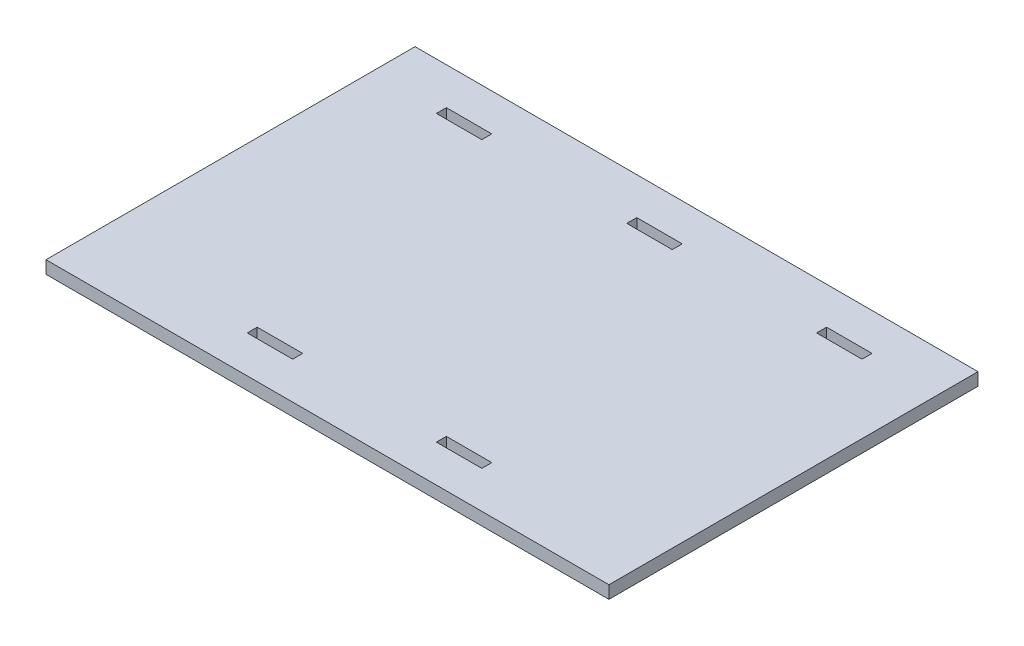
ISO-10303-21;
HEADER;
FILE_DESCRIPTION(('STEP AP214'),'2;1');
FILE_NAME('part.step','',(''),(''),'','','');
FILE_SCHEMA(('AUTOMOTIVE_DESIGN { 1 0 10303 214 1 1 1 1 }'));
ENDSEC;
DATA;
#1=APPLICATION_CONTEXT('core data for automotive mechanical design processes');
#2=APPLICATION_PROTOCOL_DEFINITION('international standard','automotive_design',2000,#1);
#3=PRODUCT_CONTEXT('',#1,'mechanical');
#4=PRODUCT('Part','Part','',(#3));
#5=PRODUCT_RELATED_PRODUCT_CATEGORY('part','',(#4));
#6=PRODUCT_DEFINITION_FORMATION('','',#4);
#7=PRODUCT_DEFINITION_CONTEXT('part definition',#1,'design');
#8=PRODUCT_DEFINITION('design','',#6,#7);
#9=PRODUCT_DEFINITION_SHAPE('','',#8);
#10=(LENGTH_UNIT() NAMED_UNIT(*) SI_UNIT(.MILLI.,.METRE.));
#11=(NAMED_UNIT(*) PLANE_ANGLE_UNIT() SI_UNIT($,.RADIAN.));
#12=(NAMED_UNIT(*) SI_UNIT($,.STERADIAN.) SOLID_ANGLE_UNIT());
#13=UNCERTAINTY_MEASURE_WITH_UNIT(LENGTH_MEASURE(1.E-05),#10,'distance_accuracy_value','');
#14=(GEOMETRIC_REPRESENTATION_CONTEXT(3) GLOBAL_UNCERTAINTY_ASSIGNED_CONTEXT((#13)) GLOBAL_UNIT_ASSIGNED_CONTEXT((#10,
#11,#12)) REPRESENTATION_CONTEXT('',''));
#15=CARTESIAN_POINT('',(0.,0.,0.));
#16=DIRECTION('',(0.,0.,1.));
#17=DIRECTION('',(1.,0.,0.));
#18=AXIS2_PLACEMENT_3D('',#15,#16,#17);
#19=CARTESIAN_POINT('',(0.,12.7,0.));
#20=DIRECTION('',(0.,-1.,0.));
#21=DIRECTION('',(0.,0.,-1.));
#22=AXIS2_PLACEMENT_3D('',#19,#20,#21);
#23=PLANE('',#22);
#24=DIRECTION('',(0.,0.,1.));
#25=VECTOR('',#24,1.);
#26=CARTESIAN_POINT('',(-22.5798679357368,12.7,0.));
#27=LINE('',#26,#25);
#28=CARTESIAN_POINT('',(-22.5798679357368,12.7,-147.500000000002));
#29=VERTEX_POINT('',#28);
#30=CARTESIAN_POINT('',(-22.5798679357368,12.7,-137.500000000002));
#31=VERTEX_POINT('',#30);
#32=EDGE_CURVE('E413',#29,#31,#27,.T.);
#33=ORIENTED_EDGE('',*,*,#32,.F.);
#34=DIRECTION('',(1.,0.,0.));
#35=VECTOR('',#34,1.);
#36=CARTESIAN_POINT('',(0.,12.7,-147.500000000002));
#37=LINE('',#36,#35);
#38=CARTESIAN_POINT('',(22.9201320642632,12.7,-147.500000000002));
#39=VERTEX_POINT('',#38);
#40=EDGE_CURVE('E402',#29,#39,#37,.T.);
#41=ORIENTED_EDGE('',*,*,#40,.T.);
#42=DIRECTION('',(0.,0.,1.));
#43=VECTOR('',#42,1.);
#44=CARTESIAN_POINT('',(22.9201320642632,12.7,0.));
#45=LINE('',#44,#43);
#46=CARTESIAN_POINT('',(22.9201320642632,12.7,-137.500000000002));
#47=VERTEX_POINT('',#46);
#48=EDGE_CURVE('E406',#39,#47,#45,.T.);
#49=ORIENTED_EDGE('',*,*,#48,.T.);
#50=DIRECTION('',(1.,0.,0.));
#51=VECTOR('',#50,1.);
#52=CARTESIAN_POINT('',(0.,12.7,-137.500000000002));
#53=LINE('',#52,#51);
#54=EDGE_CURVE('E410',#31,#47,#53,.T.);
#55=ORIENTED_EDGE('',*,*,#54,.F.);
#56=EDGE_LOOP('',(#33,#41,#49,#55));
#57=FACE_BOUND('',#56,.T.);
#58=DIRECTION('',(0.,0.,1.));
#59=VECTOR('',#58,1.);
#60=CARTESIAN_POINT('',(-117.579867935739,12.7,0.));
#61=LINE('',#60,#59);
#62=CARTESIAN_POINT('',(-117.579867935739,12.7,137.499999999997));
#63=VERTEX_POINT('',#62);
#64=CARTESIAN_POINT('',(-117.579867935739,12.7,147.499999999997));
#65=VERTEX_POINT('',#64);
#66=EDGE_CURVE('E385',#63,#65,#61,.T.);
#67=ORIENTED_EDGE('',*,*,#66,.F.);
#68=DIRECTION('',(1.,0.,0.));
#69=VECTOR('',#68,1.);
#70=CARTESIAN_POINT('',(0.,12.7,137.499999999997));
#71=LINE('',#70,#69);
#72=CARTESIAN_POINT('',(-72.079867935739,12.7,137.499999999997));
#73=VERTEX_POINT('',#72);
#74=EDGE_CURVE('E374',#63,#73,#71,.T.);
#75=ORIENTED_EDGE('',*,*,#74,.T.);
#76=DIRECTION('',(0.,0.,1.));
#77=VECTOR('',#76,1.);
#78=CARTESIAN_POINT('',(-72.079867935739,12.7,0.));
#79=LINE('',#78,#77);
#80=CARTESIAN_POINT('',(-72.079867935739,12.7,147.499999999997));
#81=VERTEX_POINT('',#80);
#82=EDGE_CURVE('E378',#73,#81,#79,.T.);
#83=ORIENTED_EDGE('',*,*,#82,.T.);
#84=DIRECTION('',(1.,0.,0.));
#85=VECTOR('',#84,1.);
#86=CARTESIAN_POINT('',(0.,12.7,147.499999999997));
#87=LINE('',#86,#85);
#88=EDGE_CURVE('E382',#65,#81,#87,.T.);
#89=ORIENTED_EDGE('',*,*,#88,.F.);
#90=EDGE_LOOP('',(#67,#75,#83,#89));
#91=FACE_BOUND('',#90,.T.);
#92=DIRECTION('',(0.,0.,-1.));
#93=VECTOR('',#92,1.);
#94=CARTESIAN_POINT('',(281.815,12.7,184.75));
#95=LINE('',#94,#93);
#96=CARTESIAN_POINT('',(281.815,12.7,184.75));
#97=VERTEX_POINT('',#96);
#98=CARTESIAN_POINT('',(281.815,12.7,-184.75));
#99=VERTEX_POINT('',#98);
#100=EDGE_CURVE('E430',#97,#99,#95,.T.);
#101=ORIENTED_EDGE('',*,*,#100,.T.);
#102=DIRECTION('',(-1.,0.,0.));
#103=VECTOR('',#102,1.);
#104=CARTESIAN_POINT('',(-281.815,12.7,-184.75));
#105=LINE('',#104,#103);
#106=CARTESIAN_POINT('',(-281.815,12.7,-184.75));
#107=VERTEX_POINT('',#106);
#108=EDGE_CURVE('E434',#99,#107,#105,.T.);
#109=ORIENTED_EDGE('',*,*,#108,.T.);
#110=DIRECTION('',(0.,0.,1.));
#111=VECTOR('',#110,1.);
#112=CARTESIAN_POINT('',(-281.815,12.7,184.75));
#113=LINE('',#112,#111);
#114=CARTESIAN_POINT('',(-281.815,12.7,184.75));
#115=VERTEX_POINT('',#114);
#116=EDGE_CURVE('E438',#107,#115,#113,.T.);
#117=ORIENTED_EDGE('',*,*,#116,.T.);
#118=DIRECTION('',(1.,0.,0.));
#119=VECTOR('',#118,1.);
#120=CARTESIAN_POINT('',(-281.815,12.7,184.75));
#121=LINE('',#120,#119);
#122=EDGE_CURVE('E441',#115,#97,#121,.T.);
#123=ORIENTED_EDGE('',*,*,#122,.T.);
#124=EDGE_LOOP('',(#101,#109,#117,#123));
#125=FACE_BOUND('',#124,.T.);
#126=DIRECTION('',(0.,0.,1.));
#127=VECTOR('',#126,1.);
#128=CARTESIAN_POINT('',(71.7642442973993,12.7,0.));
#129=LINE('',#128,#127);
#130=CARTESIAN_POINT('',(71.7642442973993,12.7,137.499999999999));
#131=VERTEX_POINT('',#130);
#132=CARTESIAN_POINT('',(71.7642442973993,12.7,147.499999999999));
#133=VERTEX_POINT('',#132);
#134=EDGE_CURVE('E371',#131,#133,#129,.T.);
#135=ORIENTED_EDGE('',*,*,#134,.F.);
#136=DIRECTION('',(1.,0.,0.));
#137=VECTOR('',#136,1.);
#138=CARTESIAN_POINT('',(0.,12.7,137.499999999999));
#139=LINE('',#138,#137);
#140=CARTESIAN_POINT('',(117.264244297399,12.7,137.499999999999));
#141=VERTEX_POINT('',#140);
#142=EDGE_CURVE('E217',#131,#141,#139,.T.);
#143=ORIENTED_EDGE('',*,*,#142,.T.);
#144=DIRECTION('',(0.,0.,1.));
#145=VECTOR('',#144,1.);
#146=CARTESIAN_POINT('',(117.264244297399,12.7,0.));
#147=LINE('',#146,#145);
#148=CARTESIAN_POINT('',(117.264244297399,12.7,147.499999999999));
#149=VERTEX_POINT('',#148);
#150=EDGE_CURVE('E364',#141,#149,#147,.T.);
#151=ORIENTED_EDGE('',*,*,#150,.T.);
#152=DIRECTION('',(1.,0.,0.));
#153=VECTOR('',#152,1.);
#154=CARTESIAN_POINT('',(0.,12.7,147.499999999999));
#155=LINE('',#154,#153);
#156=EDGE_CURVE('E368',#133,#149,#155,.T.);
#157=ORIENTED_EDGE('',*,*,#156,.F.);
#158=EDGE_LOOP('',(#135,#143,#151,#157));
#159=FACE_BOUND('',#158,.T.);
#160=DIRECTION('',(0.,0.,1.));
#161=VECTOR('',#160,1.);
#162=CARTESIAN_POINT('',(167.420132064263,12.7,0.));
#163=LINE('',#162,#161);
#164=CARTESIAN_POINT('',(167.420132064263,12.7,-147.5));
#165=VERTEX_POINT('',#164);
#166=CARTESIAN_POINT('',(167.420132064263,12.7,-137.5));
#167=VERTEX_POINT('',#166);
#168=EDGE_CURVE('E399',#165,#167,#163,.T.);
#169=ORIENTED_EDGE('',*,*,#168,.F.);
#170=DIRECTION('',(1.,0.,0.));
#171=VECTOR('',#170,1.);
#172=CARTESIAN_POINT('',(0.,12.7,-147.5));
#173=LINE('',#172,#171);
#174=CARTESIAN_POINT('',(212.920132064263,12.7,-147.5));
#175=VERTEX_POINT('',#174);
#176=EDGE_CURVE('E388',#165,#175,#173,.T.);
#177=ORIENTED_EDGE('',*,*,#176,.T.);
#178=DIRECTION('',(0.,0.,1.));
#179=VECTOR('',#178,1.);
#180=CARTESIAN_POINT('',(212.920132064263,12.7,0.));
#181=LINE('',#180,#179);
#182=CARTESIAN_POINT('',(212.920132064263,12.7,-137.5));
#183=VERTEX_POINT('',#182);
#184=EDGE_CURVE('E392',#175,#183,#181,.T.);
#185=ORIENTED_EDGE('',*,*,#184,.T.);
#186=DIRECTION('',(1.,0.,0.));
#187=VECTOR('',#186,1.);
#188=CARTESIAN_POINT('',(0.,12.7,-137.5));
#189=LINE('',#188,#187);
#190=EDGE_CURVE('E396',#167,#183,#189,.T.);
#191=ORIENTED_EDGE('',*,*,#190,.F.);
#192=EDGE_LOOP('',(#169,#177,#185,#191));
#193=FACE_BOUND('',#192,.T.);
#194=DIRECTION('',(0.,0.,1.));
#195=VECTOR('',#194,1.);
#196=CARTESIAN_POINT('',(-213.235755702599,12.7,0.));
#197=LINE('',#196,#195);
#198=CARTESIAN_POINT('',(-213.235755702599,12.7,-147.500000000003));
#199=VERTEX_POINT('',#198);
#200=CARTESIAN_POINT('',(-213.235755702599,12.7,-137.500000000003));
#201=VERTEX_POINT('',#200);
#202=EDGE_CURVE('E213',#199,#201,#197,.T.);
#203=ORIENTED_EDGE('',*,*,#202,.F.);
#204=DIRECTION('',(1.,0.,0.));
#205=VECTOR('',#204,1.);
#206=CARTESIAN_POINT('',(0.,12.7,-147.500000000003));
#207=LINE('',#206,#205);
#208=CARTESIAN_POINT('',(-167.735755702599,12.7,-147.500000000003));
#209=VERTEX_POINT('',#208);
#210=EDGE_CURVE('E416',#199,#209,#207,.T.);
#211=ORIENTED_EDGE('',*,*,#210,.T.);
#212=DIRECTION('',(0.,0.,1.));
#213=VECTOR('',#212,1.);
#214=CARTESIAN_POINT('',(-167.735755702599,12.7,0.));
#215=LINE('',#214,#213);
#216=CARTESIAN_POINT('',(-167.735755702599,12.7,-137.500000000003));
#217=VERTEX_POINT('',#216);
#218=EDGE_CURVE('E420',#209,#217,#215,.T.);
#219=ORIENTED_EDGE('',*,*,#218,.T.);
#220=DIRECTION('',(1.,0.,0.));
#221=VECTOR('',#220,1.);
#222=CARTESIAN_POINT('',(0.,12.7,-137.500000000003));
#223=LINE('',#222,#221);
#224=EDGE_CURVE('E424',#201,#217,#223,.T.);
#225=ORIENTED_EDGE('',*,*,#224,.F.);
#226=EDGE_LOOP('',(#203,#211,#219,#225));
#227=FACE_BOUND('',#226,.T.);
#228=ADVANCED_FACE('F44',(#57,#91,#125,#159,#193,#227),#23,.F.);
#229=CARTESIAN_POINT('',(0.,0.,0.));
#230=DIRECTION('',(0.,-1.,0.));
#231=DIRECTION('',(0.,0.,-1.));
#232=AXIS2_PLACEMENT_3D('',#229,#230,#231);
#233=PLANE('',#232);
#234=DIRECTION('',(0.,0.,-1.));
#235=VECTOR('',#234,1.);
#236=CARTESIAN_POINT('',(281.815,0.,184.75));
#237=LINE('',#236,#235);
#238=CARTESIAN_POINT('',(281.815,0.,184.75));
#239=VERTEX_POINT('',#238);
#240=CARTESIAN_POINT('',(281.815,0.,-184.75));
#241=VERTEX_POINT('',#240);
#242=EDGE_CURVE('E429',#239,#241,#237,.T.);
#243=ORIENTED_EDGE('',*,*,#242,.F.);
#244=DIRECTION('',(1.,0.,0.));
#245=VECTOR('',#244,1.);
#246=CARTESIAN_POINT('',(-281.815,0.,184.75));
#247=LINE('',#246,#245);
#248=CARTESIAN_POINT('',(-281.815,0.,184.75));
#249=VERTEX_POINT('',#248);
#250=EDGE_CURVE('E435',#249,#239,#247,.T.);
#251=ORIENTED_EDGE('',*,*,#250,.F.);
#252=DIRECTION('',(0.,0.,1.));
#253=VECTOR('',#252,1.);
#254=CARTESIAN_POINT('',(-281.815,0.,184.75));
#255=LINE('',#254,#253);
#256=CARTESIAN_POINT('',(-281.815,0.,-184.75));
#257=VERTEX_POINT('',#256);
#258=EDGE_CURVE('E451',#257,#249,#255,.T.);
#259=ORIENTED_EDGE('',*,*,#258,.F.);
#260=DIRECTION('',(-1.,0.,0.));
#261=VECTOR('',#260,1.);
#262=CARTESIAN_POINT('',(-281.815,0.,-184.75));
#263=LINE('',#262,#261);
#264=EDGE_CURVE('E448',#241,#257,#263,.T.);
#265=ORIENTED_EDGE('',*,*,#264,.F.);
#266=EDGE_LOOP('',(#243,#251,#259,#265));
#267=FACE_BOUND('',#266,.T.);
#268=DIRECTION('',(1.,0.,0.));
#269=VECTOR('',#268,1.);
#270=CARTESIAN_POINT('',(71.7642442973993,0.,137.499999999999));
#271=LINE('',#270,#269);
#272=CARTESIAN_POINT('',(71.7642442973993,0.,137.499999999999));
#273=VERTEX_POINT('',#272);
#274=CARTESIAN_POINT('',(117.264244297399,0.,137.499999999999));
#275=VERTEX_POINT('',#274);
#276=EDGE_CURVE('E346',#273,#275,#271,.T.);
#277=ORIENTED_EDGE('',*,*,#276,.F.);
#278=DIRECTION('',(0.,0.,1.));
#279=VECTOR('',#278,1.);
#280=CARTESIAN_POINT('',(71.7642442973993,0.,137.499999999999));
#281=LINE('',#280,#279);
#282=CARTESIAN_POINT('',(71.7642442973993,0.,147.499999999999));
#283=VERTEX_POINT('',#282);
#284=EDGE_CURVE('E308',#273,#283,#281,.T.);
#285=ORIENTED_EDGE('',*,*,#284,.T.);
#286=DIRECTION('',(1.,0.,0.));
#287=VECTOR('',#286,1.);
#288=CARTESIAN_POINT('',(71.7642442973993,0.,147.499999999999));
#289=LINE('',#288,#287);
#290=CARTESIAN_POINT('',(117.264244297399,0.,147.499999999999));
#291=VERTEX_POINT('',#290);
#292=EDGE_CURVE('E354',#283,#291,#289,.T.);
#293=ORIENTED_EDGE('',*,*,#292,.T.);
#294=DIRECTION('',(0.,0.,1.));
#295=VECTOR('',#294,1.);
#296=CARTESIAN_POINT('',(117.264244297399,0.,137.499999999999));
#297=LINE('',#296,#295);
#298=EDGE_CURVE('E350',#275,#291,#297,.T.);
#299=ORIENTED_EDGE('',*,*,#298,.F.);
#300=EDGE_LOOP('',(#277,#285,#293,#299));
#301=FACE_BOUND('',#300,.T.);
#302=DIRECTION('',(1.,0.,0.));
#303=VECTOR('',#302,1.);
#304=CARTESIAN_POINT('',(-117.579867935739,0.,137.499999999997));
#305=LINE('',#304,#303);
#306=CARTESIAN_POINT('',(-117.579867935739,0.,137.499999999997));
#307=VERTEX_POINT('',#306);
#308=CARTESIAN_POINT('',(-72.079867935739,0.,137.499999999997));
#309=VERTEX_POINT('',#308);
#310=EDGE_CURVE('E318',#307,#309,#305,.T.);
#311=ORIENTED_EDGE('',*,*,#310,.F.);
#312=DIRECTION('',(0.,0.,1.));
#313=VECTOR('',#312,1.);
#314=CARTESIAN_POINT('',(-117.579867935739,0.,137.499999999997));
#315=LINE('',#314,#313);
#316=CARTESIAN_POINT('',(-117.579867935739,0.,147.499999999997));
#317=VERTEX_POINT('',#316);
#318=EDGE_CURVE('E279',#307,#317,#315,.T.);
#319=ORIENTED_EDGE('',*,*,#318,.T.);
#320=DIRECTION('',(1.,0.,0.));
#321=VECTOR('',#320,1.);
#322=CARTESIAN_POINT('',(-117.579867935739,0.,147.499999999997));
#323=LINE('',#322,#321);
#324=CARTESIAN_POINT('',(-72.079867935739,0.,147.499999999997));
#325=VERTEX_POINT('',#324);
#326=EDGE_CURVE('E326',#317,#325,#323,.T.);
#327=ORIENTED_EDGE('',*,*,#326,.T.);
#328=DIRECTION('',(0.,0.,1.));
#329=VECTOR('',#328,1.);
#330=CARTESIAN_POINT('',(-72.079867935739,0.,137.499999999997));
#331=LINE('',#330,#329);
#332=EDGE_CURVE('E322',#309,#325,#331,.T.);
#333=ORIENTED_EDGE('',*,*,#332,.F.);
#334=EDGE_LOOP('',(#311,#319,#327,#333));
#335=FACE_BOUND('',#334,.T.);
#336=DIRECTION('',(1.,0.,0.));
#337=VECTOR('',#336,1.);
#338=CARTESIAN_POINT('',(167.420132064263,0.,-147.5));
#339=LINE('',#338,#337);
#340=CARTESIAN_POINT('',(167.420132064263,0.,-147.5));
#341=VERTEX_POINT('',#340);
#342=CARTESIAN_POINT('',(212.920132064263,0.,-147.5));
#343=VERTEX_POINT('',#342);
#344=EDGE_CURVE('E289',#341,#343,#339,.T.);
#345=ORIENTED_EDGE('',*,*,#344,.F.);
#346=DIRECTION('',(0.,0.,1.));
#347=VECTOR('',#346,1.);
#348=CARTESIAN_POINT('',(167.420132064263,0.,-147.5));
#349=LINE('',#348,#347);
#350=CARTESIAN_POINT('',(167.420132064263,0.,-137.5));
#351=VERTEX_POINT('',#350);
#352=EDGE_CURVE('E256',#341,#351,#349,.T.);
#353=ORIENTED_EDGE('',*,*,#352,.T.);
#354=DIRECTION('',(1.,0.,0.));
#355=VECTOR('',#354,1.);
#356=CARTESIAN_POINT('',(167.420132064263,0.,-137.5));
#357=LINE('',#356,#355);
#358=CARTESIAN_POINT('',(212.920132064263,0.,-137.5));
#359=VERTEX_POINT('',#358);
#360=EDGE_CURVE('E297',#351,#359,#357,.T.);
#361=ORIENTED_EDGE('',*,*,#360,.T.);
#362=DIRECTION('',(0.,0.,1.));
#363=VECTOR('',#362,1.);
#364=CARTESIAN_POINT('',(212.920132064263,0.,-147.5));
#365=LINE('',#364,#363);
#366=EDGE_CURVE('E293',#343,#359,#365,.T.);
#367=ORIENTED_EDGE('',*,*,#366,.F.);
#368=EDGE_LOOP('',(#345,#353,#361,#367));
#369=FACE_BOUND('',#368,.T.);
#370=DIRECTION('',(1.,0.,0.));
#371=VECTOR('',#370,1.);
#372=CARTESIAN_POINT('',(-22.5798679357368,0.,-147.500000000002));
#373=LINE('',#372,#371);
#374=CARTESIAN_POINT('',(-22.5798679357368,0.,-147.500000000002));
#375=VERTEX_POINT('',#374);
#376=CARTESIAN_POINT('',(22.9201320642632,0.,-147.500000000002));
#377=VERTEX_POINT('',#376);
#378=EDGE_CURVE('E265',#375,#377,#373,.T.);
#379=ORIENTED_EDGE('',*,*,#378,.F.);
#380=DIRECTION('',(0.,0.,1.));
#381=VECTOR('',#380,1.);
#382=CARTESIAN_POINT('',(-22.5798679357368,0.,-147.500000000002));
#383=LINE('',#382,#381);
#384=CARTESIAN_POINT('',(-22.5798679357368,0.,-137.500000000002));
#385=VERTEX_POINT('',#384);
#386=EDGE_CURVE('E234',#375,#385,#383,.T.);
#387=ORIENTED_EDGE('',*,*,#386,.T.);
#388=DIRECTION('',(1.,0.,0.));
#389=VECTOR('',#388,1.);
#390=CARTESIAN_POINT('',(-22.5798679357368,0.,-137.500000000002));
#391=LINE('',#390,#389);
#392=CARTESIAN_POINT('',(22.9201320642632,0.,-137.500000000002));
#393=VERTEX_POINT('',#392);
#394=EDGE_CURVE('E238',#385,#393,#391,.T.);
#395=ORIENTED_EDGE('',*,*,#394,.T.);
#396=DIRECTION('',(0.,0.,1.));
#397=VECTOR('',#396,1.);
#398=CARTESIAN_POINT('',(22.9201320642632,0.,-147.500000000002));
#399=LINE('',#398,#397);
#400=EDGE_CURVE('E268',#377,#393,#399,.T.);
#401=ORIENTED_EDGE('',*,*,#400,.F.);
#402=EDGE_LOOP('',(#379,#387,#395,#401));
#403=FACE_BOUND('',#402,.T.);
#404=DIRECTION('',(1.,0.,0.));
#405=VECTOR('',#404,1.);
#406=CARTESIAN_POINT('',(-213.235755702599,0.,-147.500000000003));
#407=LINE('',#406,#405);
#408=CARTESIAN_POINT('',(-213.235755702599,0.,-147.500000000003));
#409=VERTEX_POINT('',#408);
#410=CARTESIAN_POINT('',(-167.735755702599,0.,-147.500000000003));
#411=VERTEX_POINT('',#410);
#412=EDGE_CURVE('E232',#409,#411,#407,.T.);
#413=ORIENTED_EDGE('',*,*,#412,.F.);
#414=DIRECTION('',(0.,0.,1.));
#415=VECTOR('',#414,1.);
#416=CARTESIAN_POINT('',(-213.235755702599,0.,-147.500000000003));
#417=LINE('',#416,#415);
#418=CARTESIAN_POINT('',(-213.235755702599,0.,-137.500000000003));
#419=VERTEX_POINT('',#418);
#420=EDGE_CURVE('E210',#409,#419,#417,.T.);
#421=ORIENTED_EDGE('',*,*,#420,.T.);
#422=DIRECTION('',(1.,0.,0.));
#423=VECTOR('',#422,1.);
#424=CARTESIAN_POINT('',(-213.235755702599,0.,-137.500000000003));
#425=LINE('',#424,#423);
#426=CARTESIAN_POINT('',(-167.735755702599,0.,-137.500000000003));
#427=VERTEX_POINT('',#426);
#428=EDGE_CURVE('E221',#419,#427,#425,.T.);
#429=ORIENTED_EDGE('',*,*,#428,.T.);
#430=DIRECTION('',(0.,0.,1.));
#431=VECTOR('',#430,1.);
#432=CARTESIAN_POINT('',(-167.735755702599,0.,-147.500000000003));
#433=LINE('',#432,#431);
#434=EDGE_CURVE('E228',#411,#427,#433,.T.);
#435=ORIENTED_EDGE('',*,*,#434,.F.);
#436=EDGE_LOOP('',(#413,#421,#429,#435));
#437=FACE_BOUND('',#436,.T.);
#438=ADVANCED_FACE('F231',(#267,#301,#335,#369,#403,#437),#233,.T.);
#439=CARTESIAN_POINT('',(281.815,12.7,184.75));
#440=DIRECTION('',(-1.,0.,0.));
#441=DIRECTION('',(0.,0.,1.));
#442=AXIS2_PLACEMENT_3D('',#439,#440,#441);
#443=PLANE('',#442);
#444=ORIENTED_EDGE('',*,*,#242,.T.);
#445=DIRECTION('',(0.,-1.,0.));
#446=VECTOR('',#445,1.);
#447=CARTESIAN_POINT('',(281.815,12.7,-184.75));
#448=LINE('',#447,#446);
#449=EDGE_CURVE('E11',#99,#241,#448,.T.);
#450=ORIENTED_EDGE('',*,*,#449,.F.);
#451=ORIENTED_EDGE('',*,*,#100,.F.);
#452=DIRECTION('',(0.,-1.,0.));
#453=VECTOR('',#452,1.);
#454=CARTESIAN_POINT('',(281.815,12.7,184.75));
#455=LINE('',#454,#453);
#456=EDGE_CURVE('E444',#97,#239,#455,.T.);
#457=ORIENTED_EDGE('',*,*,#456,.T.);
#458=EDGE_LOOP('',(#444,#450,#451,#457));
#459=FACE_BOUND('',#458,.T.);
#460=ADVANCED_FACE('F46',(#459),#443,.F.);
#461=CARTESIAN_POINT('',(-281.815,12.7,-184.75));
#462=DIRECTION('',(0.,0.,1.));
#463=DIRECTION('',(1.,0.,0.));
#464=AXIS2_PLACEMENT_3D('',#461,#462,#463);
#465=PLANE('',#464);
#466=ORIENTED_EDGE('',*,*,#264,.T.);
#467=DIRECTION('',(0.,-1.,0.));
#468=VECTOR('',#467,1.);
#469=CARTESIAN_POINT('',(-281.815,12.7,-184.75));
#470=LINE('',#469,#468);
#471=EDGE_CURVE('E53',#107,#257,#470,.T.);
#472=ORIENTED_EDGE('',*,*,#471,.F.);
#473=ORIENTED_EDGE('',*,*,#108,.F.);
#474=ORIENTED_EDGE('',*,*,#449,.T.);
#475=EDGE_LOOP('',(#466,#472,#473,#474));
#476=FACE_BOUND('',#475,.T.);
#477=ADVANCED_FACE('F484',(#476),#465,.F.);
#478=CARTESIAN_POINT('',(-281.815,12.7,184.75));
#479=DIRECTION('',(1.,0.,0.));
#480=DIRECTION('',(0.,0.,-1.));
#481=AXIS2_PLACEMENT_3D('',#478,#479,#480);
#482=PLANE('',#481);
#483=ORIENTED_EDGE('',*,*,#258,.T.);
#484=DIRECTION('',(0.,-1.,0.));
#485=VECTOR('',#484,1.);
#486=CARTESIAN_POINT('',(-281.815,12.7,184.75));
#487=LINE('',#486,#485);
#488=EDGE_CURVE('E459',#115,#249,#487,.T.);
#489=ORIENTED_EDGE('',*,*,#488,.F.);
#490=ORIENTED_EDGE('',*,*,#116,.F.);
#491=ORIENTED_EDGE('',*,*,#471,.T.);
#492=EDGE_LOOP('',(#483,#489,#490,#491));
#493=FACE_BOUND('',#492,.T.);
#494=ADVANCED_FACE('F468',(#493),#482,.F.);
#495=CARTESIAN_POINT('',(-281.815,12.7,184.75));
#496=DIRECTION('',(0.,0.,-1.));
#497=DIRECTION('',(-1.,0.,0.));
#498=AXIS2_PLACEMENT_3D('',#495,#496,#497);
#499=PLANE('',#498);
#500=ORIENTED_EDGE('',*,*,#250,.T.);
#501=ORIENTED_EDGE('',*,*,#456,.F.);
#502=ORIENTED_EDGE('',*,*,#122,.F.);
#503=ORIENTED_EDGE('',*,*,#488,.T.);
#504=EDGE_LOOP('',(#500,#501,#502,#503));
#505=FACE_BOUND('',#504,.T.);
#506=ADVANCED_FACE('F477',(#505),#499,.F.);
#507=CARTESIAN_POINT('',(71.7642442973993,12.700012,137.499999999999));
#508=DIRECTION('',(1.,0.,0.));
#509=DIRECTION('',(0.,0.,-1.));
#510=AXIS2_PLACEMENT_3D('',#507,#508,#509);
#511=PLANE('',#510);
#512=ORIENTED_EDGE('',*,*,#134,.T.);
#513=DIRECTION('',(0.,-1.,0.));
#514=VECTOR('',#513,1.);
#515=CARTESIAN_POINT('',(71.7642442973993,12.700012,147.499999999999));
#516=LINE('',#515,#514);
#517=EDGE_CURVE('E333',#133,#283,#516,.T.);
#518=ORIENTED_EDGE('',*,*,#517,.T.);
#519=ORIENTED_EDGE('',*,*,#284,.F.);
#520=DIRECTION('',(0.,-1.,0.));
#521=VECTOR('',#520,1.);
#522=CARTESIAN_POINT('',(71.7642442973993,12.700012,137.499999999999));
#523=LINE('',#522,#521);
#524=EDGE_CURVE('E342',#131,#273,#523,.T.);
#525=ORIENTED_EDGE('',*,*,#524,.F.);
#526=EDGE_LOOP('',(#512,#518,#519,#525));
#527=FACE_BOUND('',#526,.T.);
#528=ADVANCED_FACE('F504',(#527),#511,.T.);
#529=CARTESIAN_POINT('',(71.7642442973993,12.700012,147.499999999999));
#530=DIRECTION('',(0.,0.,-1.));
#531=DIRECTION('',(-1.,0.,0.));
#532=AXIS2_PLACEMENT_3D('',#529,#530,#531);
#533=PLANE('',#532);
#534=ORIENTED_EDGE('',*,*,#156,.T.);
#535=DIRECTION('',(0.,-1.,0.));
#536=VECTOR('',#535,1.);
#537=CARTESIAN_POINT('',(117.264244297399,12.700012,147.499999999999));
#538=LINE('',#537,#536);
#539=EDGE_CURVE('E336',#149,#291,#538,.T.);
#540=ORIENTED_EDGE('',*,*,#539,.T.);
#541=ORIENTED_EDGE('',*,*,#292,.F.);
#542=ORIENTED_EDGE('',*,*,#517,.F.);
#543=EDGE_LOOP('',(#534,#540,#541,#542));
#544=FACE_BOUND('',#543,.T.);
#545=ADVANCED_FACE('F509',(#544),#533,.T.);
#546=CARTESIAN_POINT('',(117.264244297399,12.700012,137.499999999999));
#547=DIRECTION('',(1.,0.,0.));
#548=DIRECTION('',(0.,0.,-1.));
#549=AXIS2_PLACEMENT_3D('',#546,#547,#548);
#550=PLANE('',#549);
#551=DIRECTION('',(0.,-1.,0.));
#552=VECTOR('',#551,1.);
#553=CARTESIAN_POINT('',(117.264244297399,12.700012,137.499999999999));
#554=LINE('',#553,#552);
#555=EDGE_CURVE('E339',#141,#275,#554,.T.);
#556=ORIENTED_EDGE('',*,*,#555,.T.);
#557=ORIENTED_EDGE('',*,*,#298,.T.);
#558=ORIENTED_EDGE('',*,*,#539,.F.);
#559=ORIENTED_EDGE('',*,*,#150,.F.);
#560=EDGE_LOOP('',(#556,#557,#558,#559));
#561=FACE_BOUND('',#560,.T.);
#562=ADVANCED_FACE('F516',(#561),#550,.F.);
#563=CARTESIAN_POINT('',(71.7642442973993,12.700012,137.499999999999));
#564=DIRECTION('',(0.,0.,-1.));
#565=DIRECTION('',(-1.,0.,0.));
#566=AXIS2_PLACEMENT_3D('',#563,#564,#565);
#567=PLANE('',#566);
#568=ORIENTED_EDGE('',*,*,#524,.T.);
#569=ORIENTED_EDGE('',*,*,#276,.T.);
#570=ORIENTED_EDGE('',*,*,#555,.F.);
#571=ORIENTED_EDGE('',*,*,#142,.F.);
#572=EDGE_LOOP('',(#568,#569,#570,#571));
#573=FACE_BOUND('',#572,.T.);
#574=ADVANCED_FACE('F500',(#573),#567,.F.);
#575=CARTESIAN_POINT('',(-117.579867935739,12.700012,137.499999999997));
#576=DIRECTION('',(1.,0.,0.));
#577=DIRECTION('',(0.,0.,-1.));
#578=AXIS2_PLACEMENT_3D('',#575,#576,#577);
#579=PLANE('',#578);
#580=ORIENTED_EDGE('',*,*,#66,.T.);
#581=DIRECTION('',(0.,-1.,0.));
#582=VECTOR('',#581,1.);
#583=CARTESIAN_POINT('',(-117.579867935739,12.700012,147.499999999997));
#584=LINE('',#583,#582);
#585=EDGE_CURVE('E304',#65,#317,#584,.T.);
#586=ORIENTED_EDGE('',*,*,#585,.T.);
#587=ORIENTED_EDGE('',*,*,#318,.F.);
#588=DIRECTION('',(0.,-1.,0.));
#589=VECTOR('',#588,1.);
#590=CARTESIAN_POINT('',(-117.579867935739,12.700012,137.499999999997));
#591=LINE('',#590,#589);
#592=EDGE_CURVE('E314',#63,#307,#591,.T.);
#593=ORIENTED_EDGE('',*,*,#592,.F.);
#594=EDGE_LOOP('',(#580,#586,#587,#593));
#595=FACE_BOUND('',#594,.T.);
#596=ADVANCED_FACE('F527',(#595),#579,.T.);
#597=CARTESIAN_POINT('',(-117.579867935739,12.700012,147.499999999997));
#598=DIRECTION('',(0.,0.,-1.));
#599=DIRECTION('',(-1.,0.,0.));
#600=AXIS2_PLACEMENT_3D('',#597,#598,#599);
#601=PLANE('',#600);
#602=ORIENTED_EDGE('',*,*,#88,.T.);
#603=DIRECTION('',(0.,-1.,0.));
#604=VECTOR('',#603,1.);
#605=CARTESIAN_POINT('',(-72.079867935739,12.700012,147.499999999997));
#606=LINE('',#605,#604);
#607=EDGE_CURVE('E307',#81,#325,#606,.T.);
#608=ORIENTED_EDGE('',*,*,#607,.T.);
#609=ORIENTED_EDGE('',*,*,#326,.F.);
#610=ORIENTED_EDGE('',*,*,#585,.F.);
#611=EDGE_LOOP('',(#602,#608,#609,#610));
#612=FACE_BOUND('',#611,.T.);
#613=ADVANCED_FACE('F590',(#612),#601,.T.);
#614=CARTESIAN_POINT('',(-72.079867935739,12.700012,137.499999999997));
#615=DIRECTION('',(1.,0.,0.));
#616=DIRECTION('',(0.,0.,-1.));
#617=AXIS2_PLACEMENT_3D('',#614,#615,#616);
#618=PLANE('',#617);
#619=DIRECTION('',(0.,-1.,0.));
#620=VECTOR('',#619,1.);
#621=CARTESIAN_POINT('',(-72.079867935739,12.700012,137.499999999997));
#622=LINE('',#621,#620);
#623=EDGE_CURVE('E311',#73,#309,#622,.T.);
#624=ORIENTED_EDGE('',*,*,#623,.T.);
#625=ORIENTED_EDGE('',*,*,#332,.T.);
#626=ORIENTED_EDGE('',*,*,#607,.F.);
#627=ORIENTED_EDGE('',*,*,#82,.F.);
#628=EDGE_LOOP('',(#624,#625,#626,#627));
#629=FACE_BOUND('',#628,.T.);
#630=ADVANCED_FACE('F593',(#629),#618,.F.);
#631=CARTESIAN_POINT('',(-117.579867935739,12.700012,137.499999999997));
#632=DIRECTION('',(0.,0.,-1.));
#633=DIRECTION('',(-1.,0.,0.));
#634=AXIS2_PLACEMENT_3D('',#631,#632,#633);
#635=PLANE('',#634);
#636=ORIENTED_EDGE('',*,*,#592,.T.);
#637=ORIENTED_EDGE('',*,*,#310,.T.);
#638=ORIENTED_EDGE('',*,*,#623,.F.);
#639=ORIENTED_EDGE('',*,*,#74,.F.);
#640=EDGE_LOOP('',(#636,#637,#638,#639));
#641=FACE_BOUND('',#640,.T.);
#642=ADVANCED_FACE('F520',(#641),#635,.F.);
#643=CARTESIAN_POINT('',(167.420132064263,12.700012,-147.5));
#644=DIRECTION('',(1.,0.,0.));
#645=DIRECTION('',(0.,0.,-1.));
#646=AXIS2_PLACEMENT_3D('',#643,#644,#645);
#647=PLANE('',#646);
#648=ORIENTED_EDGE('',*,*,#168,.T.);
#649=DIRECTION('',(0.,-1.,0.));
#650=VECTOR('',#649,1.);
#651=CARTESIAN_POINT('',(167.420132064263,12.700012,-137.5));
#652=LINE('',#651,#650);
#653=EDGE_CURVE('E275',#167,#351,#652,.T.);
#654=ORIENTED_EDGE('',*,*,#653,.T.);
#655=ORIENTED_EDGE('',*,*,#352,.F.);
#656=DIRECTION('',(0.,-1.,0.));
#657=VECTOR('',#656,1.);
#658=CARTESIAN_POINT('',(167.420132064263,12.700012,-147.5));
#659=LINE('',#658,#657);
#660=EDGE_CURVE('E285',#165,#341,#659,.T.);
#661=ORIENTED_EDGE('',*,*,#660,.F.);
#662=EDGE_LOOP('',(#648,#654,#655,#661));
#663=FACE_BOUND('',#662,.T.);
#664=ADVANCED_FACE('F573',(#663),#647,.T.);
#665=CARTESIAN_POINT('',(167.420132064263,12.700012,-137.5));
#666=DIRECTION('',(0.,0.,-1.));
#667=DIRECTION('',(-1.,0.,0.));
#668=AXIS2_PLACEMENT_3D('',#665,#666,#667);
#669=PLANE('',#668);
#670=ORIENTED_EDGE('',*,*,#190,.T.);
#671=DIRECTION('',(0.,-1.,0.));
#672=VECTOR('',#671,1.);
#673=CARTESIAN_POINT('',(212.920132064263,12.700012,-137.5));
#674=LINE('',#673,#672);
#675=EDGE_CURVE('E278',#183,#359,#674,.T.);
#676=ORIENTED_EDGE('',*,*,#675,.T.);
#677=ORIENTED_EDGE('',*,*,#360,.F.);
#678=ORIENTED_EDGE('',*,*,#653,.F.);
#679=EDGE_LOOP('',(#670,#676,#677,#678));
#680=FACE_BOUND('',#679,.T.);
#681=ADVANCED_FACE('F576',(#680),#669,.T.);
#682=CARTESIAN_POINT('',(212.920132064263,12.700012,-147.5));
#683=DIRECTION('',(1.,0.,0.));
#684=DIRECTION('',(0.,0.,-1.));
#685=AXIS2_PLACEMENT_3D('',#682,#683,#684);
#686=PLANE('',#685);
#687=DIRECTION('',(0.,-1.,0.));
#688=VECTOR('',#687,1.);
#689=CARTESIAN_POINT('',(212.920132064263,12.700012,-147.5));
#690=LINE('',#689,#688);
#691=EDGE_CURVE('E282',#175,#343,#690,.T.);
#692=ORIENTED_EDGE('',*,*,#691,.T.);
#693=ORIENTED_EDGE('',*,*,#366,.T.);
#694=ORIENTED_EDGE('',*,*,#675,.F.);
#695=ORIENTED_EDGE('',*,*,#184,.F.);
#696=EDGE_LOOP('',(#692,#693,#694,#695));
#697=FACE_BOUND('',#696,.T.);
#698=ADVANCED_FACE('F580',(#697),#686,.F.);
#699=CARTESIAN_POINT('',(167.420132064263,12.700012,-147.5));
#700=DIRECTION('',(0.,0.,-1.));
#701=DIRECTION('',(-1.,0.,0.));
#702=AXIS2_PLACEMENT_3D('',#699,#700,#701);
#703=PLANE('',#702);
#704=ORIENTED_EDGE('',*,*,#660,.T.);
#705=ORIENTED_EDGE('',*,*,#344,.T.);
#706=ORIENTED_EDGE('',*,*,#691,.F.);
#707=ORIENTED_EDGE('',*,*,#176,.F.);
#708=EDGE_LOOP('',(#704,#705,#706,#707));
#709=FACE_BOUND('',#708,.T.);
#710=ADVANCED_FACE('F562',(#709),#703,.F.);
#711=CARTESIAN_POINT('',(-22.5798679357368,12.700012,-147.500000000002));
#712=DIRECTION('',(1.,0.,0.));
#713=DIRECTION('',(0.,0.,-1.));
#714=AXIS2_PLACEMENT_3D('',#711,#712,#713);
#715=PLANE('',#714);
#716=ORIENTED_EDGE('',*,*,#32,.T.);
#717=DIRECTION('',(0.,-1.,0.));
#718=VECTOR('',#717,1.);
#719=CARTESIAN_POINT('',(-22.5798679357368,12.700012,-137.500000000002));
#720=LINE('',#719,#718);
#721=EDGE_CURVE('E252',#31,#385,#720,.T.);
#722=ORIENTED_EDGE('',*,*,#721,.T.);
#723=ORIENTED_EDGE('',*,*,#386,.F.);
#724=DIRECTION('',(0.,-1.,0.));
#725=VECTOR('',#724,1.);
#726=CARTESIAN_POINT('',(-22.5798679357368,12.700012,-147.500000000002));
#727=LINE('',#726,#725);
#728=EDGE_CURVE('E261',#29,#375,#727,.T.);
#729=ORIENTED_EDGE('',*,*,#728,.F.);
#730=EDGE_LOOP('',(#716,#722,#723,#729));
#731=FACE_BOUND('',#730,.T.);
#732=ADVANCED_FACE('F558',(#731),#715,.T.);
#733=CARTESIAN_POINT('',(-22.5798679357368,12.700012,-137.500000000002));
#734=DIRECTION('',(0.,0.,-1.));
#735=DIRECTION('',(-1.,0.,0.));
#736=AXIS2_PLACEMENT_3D('',#733,#734,#735);
#737=PLANE('',#736);
#738=ORIENTED_EDGE('',*,*,#54,.T.);
#739=DIRECTION('',(0.,-1.,0.));
#740=VECTOR('',#739,1.);
#741=CARTESIAN_POINT('',(22.9201320642632,12.700012,-137.500000000002));
#742=LINE('',#741,#740);
#743=EDGE_CURVE('E255',#47,#393,#742,.T.);
#744=ORIENTED_EDGE('',*,*,#743,.T.);
#745=ORIENTED_EDGE('',*,*,#394,.F.);
#746=ORIENTED_EDGE('',*,*,#721,.F.);
#747=EDGE_LOOP('',(#738,#744,#745,#746));
#748=FACE_BOUND('',#747,.T.);
#749=ADVANCED_FACE('F561',(#748),#737,.T.);
#750=CARTESIAN_POINT('',(22.9201320642632,12.700012,-147.500000000002));
#751=DIRECTION('',(1.,0.,0.));
#752=DIRECTION('',(0.,0.,-1.));
#753=AXIS2_PLACEMENT_3D('',#750,#751,#752);
#754=PLANE('',#753);
#755=DIRECTION('',(0.,-1.,0.));
#756=VECTOR('',#755,1.);
#757=CARTESIAN_POINT('',(22.9201320642632,12.700012,-147.500000000002));
#758=LINE('',#757,#756);
#759=EDGE_CURVE('E68',#39,#377,#758,.T.);
#760=ORIENTED_EDGE('',*,*,#759,.T.);
#761=ORIENTED_EDGE('',*,*,#400,.T.);
#762=ORIENTED_EDGE('',*,*,#743,.F.);
#763=ORIENTED_EDGE('',*,*,#48,.F.);
#764=EDGE_LOOP('',(#760,#761,#762,#763));
#765=FACE_BOUND('',#764,.T.);
#766=ADVANCED_FACE('F566',(#765),#754,.F.);
#767=CARTESIAN_POINT('',(-22.5798679357368,12.700012,-147.500000000002));
#768=DIRECTION('',(0.,0.,-1.));
#769=DIRECTION('',(-1.,0.,0.));
#770=AXIS2_PLACEMENT_3D('',#767,#768,#769);
#771=PLANE('',#770);
#772=ORIENTED_EDGE('',*,*,#728,.T.);
#773=ORIENTED_EDGE('',*,*,#378,.T.);
#774=ORIENTED_EDGE('',*,*,#759,.F.);
#775=ORIENTED_EDGE('',*,*,#40,.F.);
#776=EDGE_LOOP('',(#772,#773,#774,#775));
#777=FACE_BOUND('',#776,.T.);
#778=ADVANCED_FACE('F557',(#777),#771,.F.);
#779=CARTESIAN_POINT('',(-213.235755702599,12.700012,-147.500000000003));
#780=DIRECTION('',(1.,0.,0.));
#781=DIRECTION('',(0.,0.,-1.));
#782=AXIS2_PLACEMENT_3D('',#779,#780,#781);
#783=PLANE('',#782);
#784=ORIENTED_EDGE('',*,*,#202,.T.);
#785=DIRECTION('',(0.,-1.,0.));
#786=VECTOR('',#785,1.);
#787=CARTESIAN_POINT('',(-213.235755702599,12.700012,-137.500000000003));
#788=LINE('',#787,#786);
#789=EDGE_CURVE('E205',#201,#419,#788,.T.);
#790=ORIENTED_EDGE('',*,*,#789,.T.);
#791=ORIENTED_EDGE('',*,*,#420,.F.);
#792=DIRECTION('',(0.,-1.,0.));
#793=VECTOR('',#792,1.);
#794=CARTESIAN_POINT('',(-213.235755702599,12.700012,-147.500000000003));
#795=LINE('',#794,#793);
#796=EDGE_CURVE('E245',#199,#409,#795,.T.);
#797=ORIENTED_EDGE('',*,*,#796,.F.);
#798=EDGE_LOOP('',(#784,#790,#791,#797));
#799=FACE_BOUND('',#798,.T.);
#800=ADVANCED_FACE('F207',(#799),#783,.T.);
#801=CARTESIAN_POINT('',(-213.235755702599,12.700012,-137.500000000003));
#802=DIRECTION('',(0.,0.,-1.));
#803=DIRECTION('',(-1.,0.,0.));
#804=AXIS2_PLACEMENT_3D('',#801,#802,#803);
#805=PLANE('',#804);
#806=ORIENTED_EDGE('',*,*,#224,.T.);
#807=DIRECTION('',(0.,-1.,0.));
#808=VECTOR('',#807,1.);
#809=CARTESIAN_POINT('',(-167.735755702599,12.700012,-137.500000000003));
#810=LINE('',#809,#808);
#811=EDGE_CURVE('E218',#217,#427,#810,.T.);
#812=ORIENTED_EDGE('',*,*,#811,.T.);
#813=ORIENTED_EDGE('',*,*,#428,.F.);
#814=ORIENTED_EDGE('',*,*,#789,.F.);
#815=EDGE_LOOP('',(#806,#812,#813,#814));
#816=FACE_BOUND('',#815,.T.);
#817=ADVANCED_FACE('F222',(#816),#805,.T.);
#818=CARTESIAN_POINT('',(-167.735755702599,12.700012,-147.500000000003));
#819=DIRECTION('',(1.,0.,0.));
#820=DIRECTION('',(0.,0.,-1.));
#821=AXIS2_PLACEMENT_3D('',#818,#819,#820);
#822=PLANE('',#821);
#823=DIRECTION('',(0.,-1.,0.));
#824=VECTOR('',#823,1.);
#825=CARTESIAN_POINT('',(-167.735755702599,12.700012,-147.500000000003));
#826=LINE('',#825,#824);
#827=EDGE_CURVE('E60',#209,#411,#826,.T.);
#828=ORIENTED_EDGE('',*,*,#827,.T.);
#829=ORIENTED_EDGE('',*,*,#434,.T.);
#830=ORIENTED_EDGE('',*,*,#811,.F.);
#831=ORIENTED_EDGE('',*,*,#218,.F.);
#832=EDGE_LOOP('',(#828,#829,#830,#831));
#833=FACE_BOUND('',#832,.T.);
#834=ADVANCED_FACE('F544',(#833),#822,.F.);
#835=CARTESIAN_POINT('',(-213.235755702599,12.700012,-147.500000000003));
#836=DIRECTION('',(0.,0.,-1.));
#837=DIRECTION('',(-1.,0.,0.));
#838=AXIS2_PLACEMENT_3D('',#835,#836,#837);
#839=PLANE('',#838);
#840=ORIENTED_EDGE('',*,*,#796,.T.);
#841=ORIENTED_EDGE('',*,*,#412,.T.);
#842=ORIENTED_EDGE('',*,*,#827,.F.);
#843=ORIENTED_EDGE('',*,*,#210,.F.);
#844=EDGE_LOOP('',(#840,#841,#842,#843));
#845=FACE_BOUND('',#844,.T.);
#846=ADVANCED_FACE('F545',(#845),#839,.F.);
#847=CLOSED_SHELL('',(#228,#438,#460,#477,#494,#506,#528,#545,#562,#574,#596,#613,#630,#642,
#664,#681,#698,#710,#732,#749,#766,#778,#800,#817,#834,#846));
#848=MANIFOLD_SOLID_BREP('B2',#847);
#849=ADVANCED_BREP_SHAPE_REPRESENTATION('',(#18,#848),#14);
#850=SHAPE_DEFINITION_REPRESENTATION(#9,#849);
ENDSEC;
END-ISO-10303-21;
